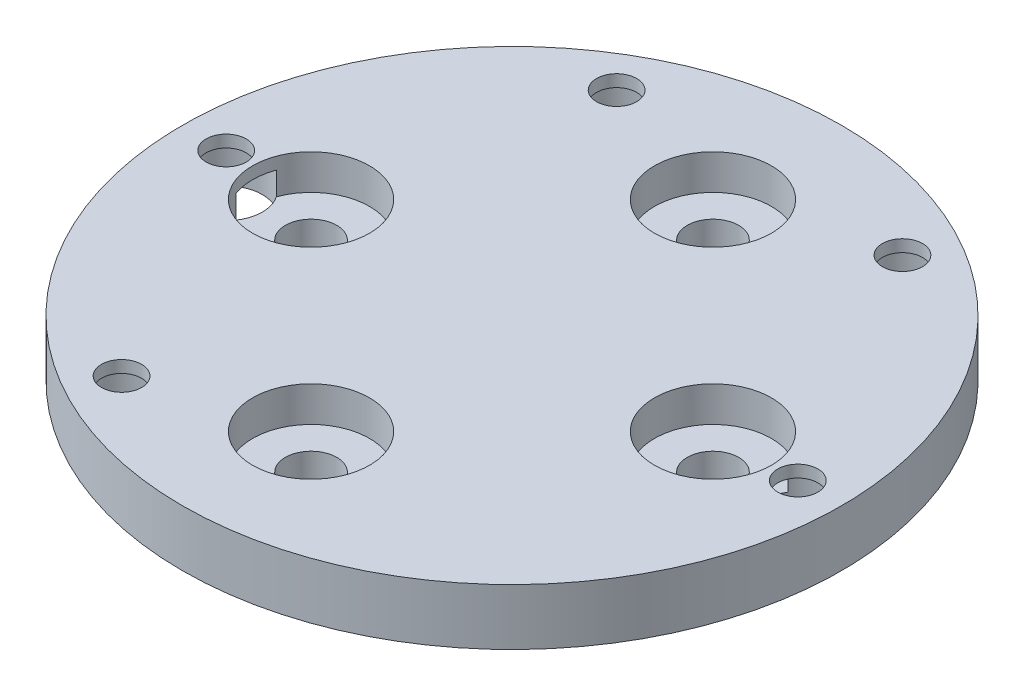
ISO-10303-21;
HEADER;
FILE_DESCRIPTION(('STEP AP214'),'2;1');
FILE_NAME('part.step','',(''),(''),'','','');
FILE_SCHEMA(('AUTOMOTIVE_DESIGN { 1 0 10303 214 1 1 1 1 }'));
ENDSEC;
DATA;
#1=APPLICATION_CONTEXT('core data for automotive mechanical design processes');
#2=APPLICATION_PROTOCOL_DEFINITION('international standard','automotive_design',2000,#1);
#3=PRODUCT_CONTEXT('',#1,'mechanical');
#4=PRODUCT('Part','Part','',(#3));
#5=PRODUCT_RELATED_PRODUCT_CATEGORY('part','',(#4));
#6=PRODUCT_DEFINITION_FORMATION('','',#4);
#7=PRODUCT_DEFINITION_CONTEXT('part definition',#1,'design');
#8=PRODUCT_DEFINITION('design','',#6,#7);
#9=PRODUCT_DEFINITION_SHAPE('','',#8);
#10=(LENGTH_UNIT() NAMED_UNIT(*) SI_UNIT(.MILLI.,.METRE.));
#11=(NAMED_UNIT(*) PLANE_ANGLE_UNIT() SI_UNIT($,.RADIAN.));
#12=(NAMED_UNIT(*) SI_UNIT($,.STERADIAN.) SOLID_ANGLE_UNIT());
#13=UNCERTAINTY_MEASURE_WITH_UNIT(LENGTH_MEASURE(1.E-05),#10,'distance_accuracy_value','');
#14=(GEOMETRIC_REPRESENTATION_CONTEXT(3) GLOBAL_UNCERTAINTY_ASSIGNED_CONTEXT((#13)) GLOBAL_UNIT_ASSIGNED_CONTEXT((#10,
#11,#12)) REPRESENTATION_CONTEXT('',''));
#15=CARTESIAN_POINT('',(0.,0.,0.));
#16=DIRECTION('',(0.,0.,1.));
#17=DIRECTION('',(1.,0.,0.));
#18=AXIS2_PLACEMENT_3D('',#15,#16,#17);
#19=CARTESIAN_POINT('',(0.,0.,0.));
#20=DIRECTION('',(0.,1.,0.));
#21=DIRECTION('',(0.,0.,1.));
#22=AXIS2_PLACEMENT_3D('',#19,#20,#21);
#23=PLANE('',#22);
#24=CARTESIAN_POINT('',(0.,0.,0.));
#25=DIRECTION('',(0.,1.,0.));
#26=DIRECTION('',(0.,0.,1.));
#27=AXIS2_PLACEMENT_3D('',#24,#25,#26);
#28=CIRCLE('',#27,41.);
#29=CARTESIAN_POINT('',(0.,0.,41.));
#30=VERTEX_POINT('',#29);
#31=EDGE_CURVE('E170',#30,#30,#28,.T.);
#32=ORIENTED_EDGE('',*,*,#31,.F.);
#33=EDGE_LOOP('',(#32));
#34=FACE_BOUND('',#33,.T.);
#35=CARTESIAN_POINT('',(17.7799999999998,0.,-30.7958633585747));
#36=DIRECTION('',(0.,-1.,0.));
#37=DIRECTION('',(0.,0.,-1.));
#38=AXIS2_PLACEMENT_3D('',#35,#36,#37);
#39=CIRCLE('',#38,4.5);
#40=CARTESIAN_POINT('',(17.7799999999998,0.,-35.2958633585747));
#41=VERTEX_POINT('',#40);
#42=EDGE_CURVE('E189',#41,#41,#39,.T.);
#43=ORIENTED_EDGE('',*,*,#42,.F.);
#44=EDGE_LOOP('',(#43));
#45=FACE_BOUND('',#44,.T.);
#46=CARTESIAN_POINT('',(-17.7800000000002,0.,-30.7958633585745));
#47=DIRECTION('',(0.,-1.,0.));
#48=DIRECTION('',(0.,0.,-1.));
#49=AXIS2_PLACEMENT_3D('',#46,#47,#48);
#50=CIRCLE('',#49,4.5);
#51=CARTESIAN_POINT('',(-17.7800000000002,0.,-35.2958633585745));
#52=VERTEX_POINT('',#51);
#53=EDGE_CURVE('E196',#52,#52,#50,.T.);
#54=ORIENTED_EDGE('',*,*,#53,.F.);
#55=EDGE_LOOP('',(#54));
#56=FACE_BOUND('',#55,.T.);
#57=CARTESIAN_POINT('',(35.56,0.,-1.31838984174237E-13));
#58=DIRECTION('',(0.,-1.,0.));
#59=DIRECTION('',(0.,0.,-1.));
#60=AXIS2_PLACEMENT_3D('',#57,#58,#59);
#61=CIRCLE('',#60,4.5);
#62=CARTESIAN_POINT('',(35.56,0.,-4.50000000000013));
#63=VERTEX_POINT('',#62);
#64=EDGE_CURVE('E88',#63,#63,#61,.T.);
#65=ORIENTED_EDGE('',*,*,#64,.F.);
#66=EDGE_LOOP('',(#65));
#67=FACE_BOUND('',#66,.T.);
#68=CARTESIAN_POINT('',(-35.56,0.,3.81639164714898E-13));
#69=DIRECTION('',(0.,-1.,0.));
#70=DIRECTION('',(0.,0.,-1.));
#71=AXIS2_PLACEMENT_3D('',#68,#69,#70);
#72=CIRCLE('',#71,4.5);
#73=CARTESIAN_POINT('',(-35.56,0.,-4.49999999999962));
#74=VERTEX_POINT('',#73);
#75=EDGE_CURVE('E87',#74,#74,#72,.T.);
#76=ORIENTED_EDGE('',*,*,#75,.F.);
#77=EDGE_LOOP('',(#76));
#78=FACE_BOUND('',#77,.T.);
#79=CARTESIAN_POINT('',(-17.78,0.,30.7958633585746));
#80=DIRECTION('',(0.,-1.,0.));
#81=DIRECTION('',(0.,0.,-1.));
#82=AXIS2_PLACEMENT_3D('',#79,#80,#81);
#83=CIRCLE('',#82,4.5);
#84=CARTESIAN_POINT('',(-17.78,0.,26.2958633585746));
#85=VERTEX_POINT('',#84);
#86=EDGE_CURVE('E207',#85,#85,#83,.T.);
#87=ORIENTED_EDGE('',*,*,#86,.F.);
#88=EDGE_LOOP('',(#87));
#89=FACE_BOUND('',#88,.T.);
#90=CARTESIAN_POINT('',(0.,0.,0.));
#91=DIRECTION('',(0.,1.,0.));
#92=DIRECTION('',(0.,0.,1.));
#93=AXIS2_PLACEMENT_3D('',#90,#91,#92);
#94=CIRCLE('',#93,30.);
#95=CARTESIAN_POINT('',(0.,0.,30.));
#96=VERTEX_POINT('',#95);
#97=EDGE_CURVE('E11',#96,#96,#94,.F.);
#98=ORIENTED_EDGE('',*,*,#97,.F.);
#99=EDGE_LOOP('',(#98));
#100=FACE_BOUND('',#99,.T.);
#101=ADVANCED_FACE('F35',(#34,#45,#56,#67,#78,#89,#100),#23,.F.);
#102=CARTESIAN_POINT('',(-17.78,0.,30.7958633585746));
#103=DIRECTION('',(0.,1.,0.));
#104=DIRECTION('',(0.,0.,1.));
#105=AXIS2_PLACEMENT_3D('',#102,#103,#104);
#106=CYLINDRICAL_SURFACE('',#105,2.49999999999999);
#107=CARTESIAN_POINT('',(-17.78,7.,30.7958633585746));
#108=DIRECTION('',(0.,1.,0.));
#109=DIRECTION('',(0.,0.,1.));
#110=AXIS2_PLACEMENT_3D('',#107,#108,#109);
#111=CIRCLE('',#110,2.49999999999999);
#112=CARTESIAN_POINT('',(-17.78,7.,33.2958633585746));
#113=VERTEX_POINT('',#112);
#114=EDGE_CURVE('E117',#113,#113,#111,.T.);
#115=ORIENTED_EDGE('',*,*,#114,.T.);
#116=EDGE_LOOP('',(#115));
#117=FACE_BOUND('',#116,.T.);
#118=CARTESIAN_POINT('',(-17.78,5.5,30.7958633585746));
#119=DIRECTION('',(0.,-1.,0.));
#120=DIRECTION('',(0.,0.,-1.));
#121=AXIS2_PLACEMENT_3D('',#118,#119,#120);
#122=CIRCLE('',#121,2.49999999999999);
#123=CARTESIAN_POINT('',(-17.78,5.5,28.2958633585746));
#124=VERTEX_POINT('',#123);
#125=EDGE_CURVE('E123',#124,#124,#122,.F.);
#126=ORIENTED_EDGE('',*,*,#125,.F.);
#127=EDGE_LOOP('',(#126));
#128=FACE_BOUND('',#127,.T.);
#129=ADVANCED_FACE('F247',(#117,#128),#106,.F.);
#130=CARTESIAN_POINT('',(-35.56,0.,3.81639164714898E-13));
#131=DIRECTION('',(0.,1.,0.));
#132=DIRECTION('',(0.,0.,1.));
#133=AXIS2_PLACEMENT_3D('',#130,#131,#132);
#134=CYLINDRICAL_SURFACE('',#133,2.49999999999999);
#135=CARTESIAN_POINT('',(-35.56,7.,3.81639164714898E-13));
#136=DIRECTION('',(0.,1.,0.));
#137=DIRECTION('',(0.,0.,1.));
#138=AXIS2_PLACEMENT_3D('',#135,#136,#137);
#139=CIRCLE('',#138,2.49999999999999);
#140=CARTESIAN_POINT('',(-35.56,7.,2.50000000000037));
#141=VERTEX_POINT('',#140);
#142=EDGE_CURVE('E121',#141,#141,#139,.T.);
#143=ORIENTED_EDGE('',*,*,#142,.T.);
#144=EDGE_LOOP('',(#143));
#145=FACE_BOUND('',#144,.T.);
#146=CARTESIAN_POINT('',(-35.56,5.5,3.81639164714898E-13));
#147=DIRECTION('',(0.,-1.,0.));
#148=DIRECTION('',(0.,0.,-1.));
#149=AXIS2_PLACEMENT_3D('',#146,#147,#148);
#150=CIRCLE('',#149,2.49999999999999);
#151=CARTESIAN_POINT('',(-35.56,5.5,-2.49999999999961));
#152=VERTEX_POINT('',#151);
#153=EDGE_CURVE('E183',#152,#152,#150,.F.);
#154=ORIENTED_EDGE('',*,*,#153,.F.);
#155=EDGE_LOOP('',(#154));
#156=FACE_BOUND('',#155,.T.);
#157=ADVANCED_FACE('F252',(#145,#156),#134,.F.);
#158=CARTESIAN_POINT('',(-17.7800000000002,0.,-30.7958633585745));
#159=DIRECTION('',(0.,1.,0.));
#160=DIRECTION('',(0.,0.,1.));
#161=AXIS2_PLACEMENT_3D('',#158,#159,#160);
#162=CYLINDRICAL_SURFACE('',#161,2.49999999999999);
#163=CARTESIAN_POINT('',(-17.7800000000002,7.,-30.7958633585745));
#164=DIRECTION('',(0.,1.,0.));
#165=DIRECTION('',(0.,0.,1.));
#166=AXIS2_PLACEMENT_3D('',#163,#164,#165);
#167=CIRCLE('',#166,2.49999999999999);
#168=CARTESIAN_POINT('',(-17.7800000000002,7.,-28.2958633585745));
#169=VERTEX_POINT('',#168);
#170=EDGE_CURVE('E134',#169,#169,#167,.T.);
#171=ORIENTED_EDGE('',*,*,#170,.T.);
#172=EDGE_LOOP('',(#171));
#173=FACE_BOUND('',#172,.T.);
#174=CARTESIAN_POINT('',(-17.7800000000002,5.5,-30.7958633585745));
#175=DIRECTION('',(0.,-1.,0.));
#176=DIRECTION('',(0.,0.,-1.));
#177=AXIS2_PLACEMENT_3D('',#174,#175,#176);
#178=CIRCLE('',#177,2.49999999999999);
#179=CARTESIAN_POINT('',(-17.7800000000002,5.5,-33.2958633585745));
#180=VERTEX_POINT('',#179);
#181=EDGE_CURVE('E180',#180,#180,#178,.F.);
#182=ORIENTED_EDGE('',*,*,#181,.F.);
#183=EDGE_LOOP('',(#182));
#184=FACE_BOUND('',#183,.T.);
#185=ADVANCED_FACE('F306',(#173,#184),#162,.F.);
#186=CARTESIAN_POINT('',(17.7799999999998,0.,-30.7958633585747));
#187=DIRECTION('',(0.,1.,0.));
#188=DIRECTION('',(0.,0.,1.));
#189=AXIS2_PLACEMENT_3D('',#186,#187,#188);
#190=CYLINDRICAL_SURFACE('',#189,2.49999999999999);
#191=CARTESIAN_POINT('',(17.7799999999998,7.,-30.7958633585747));
#192=DIRECTION('',(0.,1.,0.));
#193=DIRECTION('',(0.,0.,1.));
#194=AXIS2_PLACEMENT_3D('',#191,#192,#193);
#195=CIRCLE('',#194,2.49999999999999);
#196=CARTESIAN_POINT('',(17.7799999999998,7.,-28.2958633585747));
#197=VERTEX_POINT('',#196);
#198=EDGE_CURVE('E131',#197,#197,#195,.T.);
#199=ORIENTED_EDGE('',*,*,#198,.T.);
#200=EDGE_LOOP('',(#199));
#201=FACE_BOUND('',#200,.T.);
#202=CARTESIAN_POINT('',(17.7799999999998,5.5,-30.7958633585747));
#203=DIRECTION('',(0.,-1.,0.));
#204=DIRECTION('',(0.,0.,-1.));
#205=AXIS2_PLACEMENT_3D('',#202,#203,#204);
#206=CIRCLE('',#205,2.49999999999999);
#207=CARTESIAN_POINT('',(17.7799999999998,5.5,-33.2958633585747));
#208=VERTEX_POINT('',#207);
#209=EDGE_CURVE('E79',#208,#208,#206,.F.);
#210=ORIENTED_EDGE('',*,*,#209,.F.);
#211=EDGE_LOOP('',(#210));
#212=FACE_BOUND('',#211,.T.);
#213=ADVANCED_FACE('F310',(#201,#212),#190,.F.);
#214=CARTESIAN_POINT('',(35.56,0.,-1.31838984174237E-13));
#215=DIRECTION('',(0.,1.,0.));
#216=DIRECTION('',(0.,0.,1.));
#217=AXIS2_PLACEMENT_3D('',#214,#215,#216);
#218=CYLINDRICAL_SURFACE('',#217,2.49999999999999);
#219=CARTESIAN_POINT('',(35.56,7.,-1.31838984174237E-13));
#220=DIRECTION('',(0.,1.,0.));
#221=DIRECTION('',(0.,0.,1.));
#222=AXIS2_PLACEMENT_3D('',#219,#220,#221);
#223=CIRCLE('',#222,2.49999999999999);
#224=CARTESIAN_POINT('',(35.56,7.,2.49999999999986));
#225=VERTEX_POINT('',#224);
#226=EDGE_CURVE('E127',#225,#225,#223,.T.);
#227=ORIENTED_EDGE('',*,*,#226,.T.);
#228=EDGE_LOOP('',(#227));
#229=FACE_BOUND('',#228,.T.);
#230=CARTESIAN_POINT('',(35.56,5.5,-1.31838984174237E-13));
#231=DIRECTION('',(0.,-1.,0.));
#232=DIRECTION('',(0.,0.,-1.));
#233=AXIS2_PLACEMENT_3D('',#230,#231,#232);
#234=CIRCLE('',#233,2.49999999999999);
#235=CARTESIAN_POINT('',(35.56,5.5,-2.50000000000012));
#236=VERTEX_POINT('',#235);
#237=EDGE_CURVE('E80',#236,#236,#234,.F.);
#238=ORIENTED_EDGE('',*,*,#237,.F.);
#239=EDGE_LOOP('',(#238));
#240=FACE_BOUND('',#239,.T.);
#241=ADVANCED_FACE('F314',(#229,#240),#218,.F.);
#242=CARTESIAN_POINT('',(0.,7.,0.));
#243=DIRECTION('',(0.,-1.,0.));
#244=DIRECTION('',(0.,0.,-1.));
#245=AXIS2_PLACEMENT_3D('',#242,#243,#244);
#246=CYLINDRICAL_SURFACE('',#245,41.);
#247=CARTESIAN_POINT('',(0.,7.,0.));
#248=DIRECTION('',(0.,1.,0.));
#249=DIRECTION('',(0.,0.,1.));
#250=AXIS2_PLACEMENT_3D('',#247,#248,#249);
#251=CIRCLE('',#250,41.);
#252=CARTESIAN_POINT('',(0.,7.,41.));
#253=VERTEX_POINT('',#252);
#254=EDGE_CURVE('E99',#253,#253,#251,.T.);
#255=ORIENTED_EDGE('',*,*,#254,.F.);
#256=EDGE_LOOP('',(#255));
#257=FACE_BOUND('',#256,.T.);
#258=ORIENTED_EDGE('',*,*,#31,.T.);
#259=EDGE_LOOP('',(#258));
#260=FACE_BOUND('',#259,.T.);
#261=ADVANCED_FACE('F37',(#257,#260),#246,.T.);
#262=CARTESIAN_POINT('',(0.,7.,0.));
#263=DIRECTION('',(0.,1.,0.));
#264=DIRECTION('',(0.,0.,1.));
#265=AXIS2_PLACEMENT_3D('',#262,#263,#264);
#266=PLANE('',#265);
#267=ORIENTED_EDGE('',*,*,#226,.F.);
#268=EDGE_LOOP('',(#267));
#269=FACE_BOUND('',#268,.T.);
#270=ORIENTED_EDGE('',*,*,#198,.F.);
#271=EDGE_LOOP('',(#270));
#272=FACE_BOUND('',#271,.T.);
#273=ORIENTED_EDGE('',*,*,#170,.F.);
#274=EDGE_LOOP('',(#273));
#275=FACE_BOUND('',#274,.T.);
#276=ORIENTED_EDGE('',*,*,#142,.F.);
#277=EDGE_LOOP('',(#276));
#278=FACE_BOUND('',#277,.T.);
#279=ORIENTED_EDGE('',*,*,#114,.F.);
#280=EDGE_LOOP('',(#279));
#281=FACE_BOUND('',#280,.T.);
#282=CARTESIAN_POINT('',(25.,7.,-2.61861100413235E-13));
#283=DIRECTION('',(0.,1.,0.));
#284=DIRECTION('',(0.,0.,1.));
#285=AXIS2_PLACEMENT_3D('',#282,#283,#284);
#286=CIRCLE('',#285,7.275);
#287=CARTESIAN_POINT('',(25.,7.,7.27499999999973));
#288=VERTEX_POINT('',#287);
#289=EDGE_CURVE('E130',#288,#288,#286,.T.);
#290=ORIENTED_EDGE('',*,*,#289,.F.);
#291=EDGE_LOOP('',(#290));
#292=FACE_BOUND('',#291,.T.);
#293=CARTESIAN_POINT('',(0.,7.,25.));
#294=DIRECTION('',(0.,1.,0.));
#295=DIRECTION('',(0.,0.,1.));
#296=AXIS2_PLACEMENT_3D('',#293,#294,#295);
#297=CIRCLE('',#296,7.27499999999999);
#298=CARTESIAN_POINT('',(0.,7.,32.275));
#299=VERTEX_POINT('',#298);
#300=EDGE_CURVE('E145',#299,#299,#297,.T.);
#301=ORIENTED_EDGE('',*,*,#300,.F.);
#302=EDGE_LOOP('',(#301));
#303=FACE_BOUND('',#302,.T.);
#304=CARTESIAN_POINT('',(-25.,7.,0.));
#305=DIRECTION('',(0.,1.,0.));
#306=DIRECTION('',(0.,0.,1.));
#307=AXIS2_PLACEMENT_3D('',#304,#305,#306);
#308=CIRCLE('',#307,7.27499999999999);
#309=CARTESIAN_POINT('',(-25.,7.,7.27500000000008));
#310=VERTEX_POINT('',#309);
#311=EDGE_CURVE('E154',#310,#310,#308,.T.);
#312=ORIENTED_EDGE('',*,*,#311,.F.);
#313=EDGE_LOOP('',(#312));
#314=FACE_BOUND('',#313,.T.);
#315=CARTESIAN_POINT('',(0.,7.,-25.));
#316=DIRECTION('',(0.,1.,0.));
#317=DIRECTION('',(0.,0.,1.));
#318=AXIS2_PLACEMENT_3D('',#315,#316,#317);
#319=CIRCLE('',#318,7.27499999999999);
#320=CARTESIAN_POINT('',(0.,7.,-17.725));
#321=VERTEX_POINT('',#320);
#322=EDGE_CURVE('E161',#321,#321,#319,.T.);
#323=ORIENTED_EDGE('',*,*,#322,.F.);
#324=EDGE_LOOP('',(#323));
#325=FACE_BOUND('',#324,.T.);
#326=ORIENTED_EDGE('',*,*,#254,.T.);
#327=EDGE_LOOP('',(#326));
#328=FACE_BOUND('',#327,.T.);
#329=ADVANCED_FACE('F258',(#269,#272,#275,#278,#281,#292,#303,#314,#325,#328),#266,.T.);
#330=CARTESIAN_POINT('',(0.,7.,-25.));
#331=DIRECTION('',(0.,1.,0.));
#332=DIRECTION('',(0.,0.,1.));
#333=AXIS2_PLACEMENT_3D('',#330,#331,#332);
#334=CYLINDRICAL_SURFACE('',#333,3.2);
#335=CARTESIAN_POINT('',(0.,2.62,-25.));
#336=DIRECTION('',(0.,1.,0.));
#337=DIRECTION('',(0.,0.,1.));
#338=AXIS2_PLACEMENT_3D('',#335,#336,#337);
#339=CIRCLE('',#338,3.2);
#340=CARTESIAN_POINT('',(0.,2.62,-21.8));
#341=VERTEX_POINT('',#340);
#342=EDGE_CURVE('E167',#341,#341,#339,.T.);
#343=ORIENTED_EDGE('',*,*,#342,.T.);
#344=EDGE_LOOP('',(#343));
#345=FACE_BOUND('',#344,.T.);
#346=CARTESIAN_POINT('',(0.,-7.,-25.));
#347=DIRECTION('',(0.,-1.,0.));
#348=DIRECTION('',(0.,0.,-1.));
#349=AXIS2_PLACEMENT_3D('',#346,#347,#348);
#350=CIRCLE('',#349,3.20000000000001);
#351=CARTESIAN_POINT('',(0.,-7.,-28.2));
#352=VERTEX_POINT('',#351);
#353=EDGE_CURVE('E217',#352,#352,#350,.T.);
#354=ORIENTED_EDGE('',*,*,#353,.T.);
#355=EDGE_LOOP('',(#354));
#356=FACE_BOUND('',#355,.T.);
#357=ADVANCED_FACE('F261',(#345,#356),#334,.F.);
#358=CARTESIAN_POINT('',(3.2,2.62,-25.));
#359=DIRECTION('',(0.,-1.,0.));
#360=DIRECTION('',(0.,0.,-1.));
#361=AXIS2_PLACEMENT_3D('',#358,#359,#360);
#362=PLANE('',#361);
#363=ORIENTED_EDGE('',*,*,#342,.F.);
#364=EDGE_LOOP('',(#363));
#365=FACE_BOUND('',#364,.T.);
#366=CARTESIAN_POINT('',(0.,2.62,-25.));
#367=DIRECTION('',(0.,1.,0.));
#368=DIRECTION('',(0.,0.,1.));
#369=AXIS2_PLACEMENT_3D('',#366,#367,#368);
#370=CIRCLE('',#369,7.275);
#371=CARTESIAN_POINT('',(0.,2.62,-17.725));
#372=VERTEX_POINT('',#371);
#373=EDGE_CURVE('E164',#372,#372,#370,.T.);
#374=ORIENTED_EDGE('',*,*,#373,.T.);
#375=EDGE_LOOP('',(#374));
#376=FACE_BOUND('',#375,.T.);
#377=ADVANCED_FACE('F265',(#365,#376),#362,.F.);
#378=CARTESIAN_POINT('',(0.,7.,-25.));
#379=DIRECTION('',(0.,1.,0.));
#380=DIRECTION('',(0.,0.,1.));
#381=AXIS2_PLACEMENT_3D('',#378,#379,#380);
#382=CYLINDRICAL_SURFACE('',#381,7.275);
#383=ORIENTED_EDGE('',*,*,#373,.F.);
#384=EDGE_LOOP('',(#383));
#385=FACE_BOUND('',#384,.T.);
#386=ORIENTED_EDGE('',*,*,#322,.T.);
#387=EDGE_LOOP('',(#386));
#388=FACE_BOUND('',#387,.T.);
#389=ADVANCED_FACE('F269',(#385,#388),#382,.F.);
#390=CARTESIAN_POINT('',(-25.,7.,0.));
#391=DIRECTION('',(0.,1.,0.));
#392=DIRECTION('',(0.,0.,1.));
#393=AXIS2_PLACEMENT_3D('',#390,#391,#392);
#394=CYLINDRICAL_SURFACE('',#393,3.2);
#395=CARTESIAN_POINT('',(-25.,2.62,0.));
#396=DIRECTION('',(0.,1.,0.));
#397=DIRECTION('',(0.,0.,1.));
#398=AXIS2_PLACEMENT_3D('',#395,#396,#397);
#399=CIRCLE('',#398,3.2);
#400=CARTESIAN_POINT('',(-25.,2.62,3.20000000000008));
#401=VERTEX_POINT('',#400);
#402=EDGE_CURVE('E158',#401,#401,#399,.T.);
#403=ORIENTED_EDGE('',*,*,#402,.T.);
#404=EDGE_LOOP('',(#403));
#405=FACE_BOUND('',#404,.T.);
#406=CARTESIAN_POINT('',(-25.,-7.,0.));
#407=DIRECTION('',(0.,-1.,0.));
#408=DIRECTION('',(0.,0.,-1.));
#409=AXIS2_PLACEMENT_3D('',#406,#407,#408);
#410=CIRCLE('',#409,3.20000000000001);
#411=CARTESIAN_POINT('',(-25.,-7.,-3.19999999999992));
#412=VERTEX_POINT('',#411);
#413=EDGE_CURVE('E220',#412,#412,#410,.T.);
#414=ORIENTED_EDGE('',*,*,#413,.T.);
#415=EDGE_LOOP('',(#414));
#416=FACE_BOUND('',#415,.T.);
#417=ADVANCED_FACE('F273',(#405,#416),#394,.F.);
#418=CARTESIAN_POINT('',(-21.8,2.62,0.));
#419=DIRECTION('',(0.,-1.,0.));
#420=DIRECTION('',(0.,0.,-1.));
#421=AXIS2_PLACEMENT_3D('',#418,#419,#420);
#422=PLANE('',#421);
#423=ORIENTED_EDGE('',*,*,#402,.F.);
#424=EDGE_LOOP('',(#423));
#425=FACE_BOUND('',#424,.T.);
#426=CARTESIAN_POINT('',(-25.,2.62,0.));
#427=DIRECTION('',(0.,1.,0.));
#428=DIRECTION('',(0.,0.,1.));
#429=AXIS2_PLACEMENT_3D('',#426,#427,#428);
#430=CIRCLE('',#429,7.275);
#431=CARTESIAN_POINT('',(-31.8271413352272,2.62,2.51311881709412));
#432=VERTEX_POINT('',#431);
#433=CARTESIAN_POINT('',(-31.8271413352273,2.62,-2.51311881709357));
#434=VERTEX_POINT('',#433);
#435=EDGE_CURVE('E110',#432,#434,#430,.T.);
#436=ORIENTED_EDGE('',*,*,#435,.T.);
#437=CARTESIAN_POINT('',(-35.56,2.62,3.81639164714898E-13));
#438=DIRECTION('',(0.,-1.,0.));
#439=DIRECTION('',(0.,0.,-1.));
#440=AXIS2_PLACEMENT_3D('',#437,#438,#439);
#441=CIRCLE('',#440,4.5);
#442=EDGE_CURVE('E114',#434,#432,#441,.T.);
#443=ORIENTED_EDGE('',*,*,#442,.T.);
#444=EDGE_LOOP('',(#436,#443));
#445=FACE_BOUND('',#444,.T.);
#446=ADVANCED_FACE('F116',(#425,#445),#422,.F.);
#447=CARTESIAN_POINT('',(-25.,7.,0.));
#448=DIRECTION('',(0.,1.,0.));
#449=DIRECTION('',(0.,0.,1.));
#450=AXIS2_PLACEMENT_3D('',#447,#448,#449);
#451=CYLINDRICAL_SURFACE('',#450,7.275);
#452=ORIENTED_EDGE('',*,*,#435,.F.);
#453=DIRECTION('',(0.,-1.,0.));
#454=VECTOR('',#453,1.);
#455=CARTESIAN_POINT('',(-31.8271413352272,2.75,2.51311881709412));
#456=LINE('',#455,#454);
#457=CARTESIAN_POINT('',(-31.8271413352272,5.5,2.51311881709412));
#458=VERTEX_POINT('',#457);
#459=EDGE_CURVE('E43',#432,#458,#456,.F.);
#460=ORIENTED_EDGE('',*,*,#459,.T.);
#461=CARTESIAN_POINT('',(-25.,5.5,0.));
#462=DIRECTION('',(0.,-1.,0.));
#463=DIRECTION('',(0.,0.,-1.));
#464=AXIS2_PLACEMENT_3D('',#461,#462,#463);
#465=CIRCLE('',#464,7.275);
#466=CARTESIAN_POINT('',(-31.8271413352273,5.5,-2.51311881709357));
#467=VERTEX_POINT('',#466);
#468=EDGE_CURVE('E108',#467,#458,#465,.F.);
#469=ORIENTED_EDGE('',*,*,#468,.F.);
#470=DIRECTION('',(0.,-1.,0.));
#471=VECTOR('',#470,1.);
#472=CARTESIAN_POINT('',(-31.8271413352273,2.75,-2.51311881709357));
#473=LINE('',#472,#471);
#474=EDGE_CURVE('E95',#467,#434,#473,.T.);
#475=ORIENTED_EDGE('',*,*,#474,.T.);
#476=EDGE_LOOP('',(#452,#460,#469,#475));
#477=FACE_BOUND('',#476,.T.);
#478=ORIENTED_EDGE('',*,*,#311,.T.);
#479=EDGE_LOOP('',(#478));
#480=FACE_BOUND('',#479,.T.);
#481=ADVANCED_FACE('F106',(#477,#480),#451,.F.);
#482=CARTESIAN_POINT('',(0.,7.,25.));
#483=DIRECTION('',(0.,1.,0.));
#484=DIRECTION('',(0.,0.,1.));
#485=AXIS2_PLACEMENT_3D('',#482,#483,#484);
#486=CYLINDRICAL_SURFACE('',#485,3.2);
#487=CARTESIAN_POINT('',(0.,2.62,25.));
#488=DIRECTION('',(0.,1.,0.));
#489=DIRECTION('',(0.,0.,1.));
#490=AXIS2_PLACEMENT_3D('',#487,#488,#489);
#491=CIRCLE('',#490,3.2);
#492=CARTESIAN_POINT('',(0.,2.62,28.2));
#493=VERTEX_POINT('',#492);
#494=EDGE_CURVE('E151',#493,#493,#491,.T.);
#495=ORIENTED_EDGE('',*,*,#494,.T.);
#496=EDGE_LOOP('',(#495));
#497=FACE_BOUND('',#496,.T.);
#498=CARTESIAN_POINT('',(0.,-7.,25.));
#499=DIRECTION('',(0.,-1.,0.));
#500=DIRECTION('',(0.,0.,-1.));
#501=AXIS2_PLACEMENT_3D('',#498,#499,#500);
#502=CIRCLE('',#501,3.20000000000001);
#503=CARTESIAN_POINT('',(0.,-7.,21.8));
#504=VERTEX_POINT('',#503);
#505=EDGE_CURVE('E223',#504,#504,#502,.T.);
#506=ORIENTED_EDGE('',*,*,#505,.T.);
#507=EDGE_LOOP('',(#506));
#508=FACE_BOUND('',#507,.T.);
#509=ADVANCED_FACE('F227',(#497,#508),#486,.F.);
#510=CARTESIAN_POINT('',(3.2,2.62,25.));
#511=DIRECTION('',(0.,-1.,0.));
#512=DIRECTION('',(0.,0.,-1.));
#513=AXIS2_PLACEMENT_3D('',#510,#511,#512);
#514=PLANE('',#513);
#515=ORIENTED_EDGE('',*,*,#494,.F.);
#516=EDGE_LOOP('',(#515));
#517=FACE_BOUND('',#516,.T.);
#518=CARTESIAN_POINT('',(0.,2.62,25.));
#519=DIRECTION('',(0.,1.,0.));
#520=DIRECTION('',(0.,0.,1.));
#521=AXIS2_PLACEMENT_3D('',#518,#519,#520);
#522=CIRCLE('',#521,7.275);
#523=CARTESIAN_POINT('',(0.,2.62,32.275));
#524=VERTEX_POINT('',#523);
#525=EDGE_CURVE('E148',#524,#524,#522,.T.);
#526=ORIENTED_EDGE('',*,*,#525,.T.);
#527=EDGE_LOOP('',(#526));
#528=FACE_BOUND('',#527,.T.);
#529=ADVANCED_FACE('F285',(#517,#528),#514,.F.);
#530=CARTESIAN_POINT('',(0.,7.,25.));
#531=DIRECTION('',(0.,1.,0.));
#532=DIRECTION('',(0.,0.,1.));
#533=AXIS2_PLACEMENT_3D('',#530,#531,#532);
#534=CYLINDRICAL_SURFACE('',#533,7.275);
#535=ORIENTED_EDGE('',*,*,#525,.F.);
#536=EDGE_LOOP('',(#535));
#537=FACE_BOUND('',#536,.T.);
#538=ORIENTED_EDGE('',*,*,#300,.T.);
#539=EDGE_LOOP('',(#538));
#540=FACE_BOUND('',#539,.T.);
#541=ADVANCED_FACE('F289',(#537,#540),#534,.F.);
#542=CARTESIAN_POINT('',(25.,7.,-2.61861100413235E-13));
#543=DIRECTION('',(0.,1.,0.));
#544=DIRECTION('',(0.,0.,1.));
#545=AXIS2_PLACEMENT_3D('',#542,#543,#544);
#546=CYLINDRICAL_SURFACE('',#545,3.2);
#547=CARTESIAN_POINT('',(25.,2.62,-2.61861100413235E-13));
#548=DIRECTION('',(0.,1.,0.));
#549=DIRECTION('',(0.,0.,1.));
#550=AXIS2_PLACEMENT_3D('',#547,#548,#549);
#551=CIRCLE('',#550,3.2);
#552=CARTESIAN_POINT('',(25.,2.62,3.19999999999974));
#553=VERTEX_POINT('',#552);
#554=EDGE_CURVE('E142',#553,#553,#551,.T.);
#555=ORIENTED_EDGE('',*,*,#554,.T.);
#556=EDGE_LOOP('',(#555));
#557=FACE_BOUND('',#556,.T.);
#558=CARTESIAN_POINT('',(25.,-7.,-2.61861100413235E-13));
#559=DIRECTION('',(0.,-1.,0.));
#560=DIRECTION('',(0.,0.,-1.));
#561=AXIS2_PLACEMENT_3D('',#558,#559,#560);
#562=CIRCLE('',#561,3.20000000000001);
#563=CARTESIAN_POINT('',(25.,-7.,-3.20000000000027));
#564=VERTEX_POINT('',#563);
#565=EDGE_CURVE('E214',#564,#564,#562,.T.);
#566=ORIENTED_EDGE('',*,*,#565,.T.);
#567=EDGE_LOOP('',(#566));
#568=FACE_BOUND('',#567,.T.);
#569=ADVANCED_FACE('F293',(#557,#568),#546,.F.);
#570=CARTESIAN_POINT('',(28.2,2.62,-2.61861100413235E-13));
#571=DIRECTION('',(0.,-1.,0.));
#572=DIRECTION('',(0.,0.,-1.));
#573=AXIS2_PLACEMENT_3D('',#570,#571,#572);
#574=PLANE('',#573);
#575=ORIENTED_EDGE('',*,*,#554,.F.);
#576=EDGE_LOOP('',(#575));
#577=FACE_BOUND('',#576,.T.);
#578=CARTESIAN_POINT('',(25.,2.62,-2.61861100413235E-13));
#579=DIRECTION('',(0.,1.,0.));
#580=DIRECTION('',(0.,0.,1.));
#581=AXIS2_PLACEMENT_3D('',#578,#579,#580);
#582=CIRCLE('',#581,7.275);
#583=CARTESIAN_POINT('',(31.8271413352273,2.62,-2.51311881709402));
#584=VERTEX_POINT('',#583);
#585=CARTESIAN_POINT('',(31.8271413352272,2.62,2.51311881709366));
#586=VERTEX_POINT('',#585);
#587=EDGE_CURVE('E94',#584,#586,#582,.T.);
#588=ORIENTED_EDGE('',*,*,#587,.T.);
#589=CARTESIAN_POINT('',(35.56,2.62,-1.31838984174237E-13));
#590=DIRECTION('',(0.,-1.,0.));
#591=DIRECTION('',(0.,0.,-1.));
#592=AXIS2_PLACEMENT_3D('',#589,#590,#591);
#593=CIRCLE('',#592,4.5);
#594=EDGE_CURVE('E118',#586,#584,#593,.T.);
#595=ORIENTED_EDGE('',*,*,#594,.T.);
#596=EDGE_LOOP('',(#588,#595));
#597=FACE_BOUND('',#596,.T.);
#598=ADVANCED_FACE('F297',(#577,#597),#574,.F.);
#599=CARTESIAN_POINT('',(25.,7.,-2.61861100413235E-13));
#600=DIRECTION('',(0.,1.,0.));
#601=DIRECTION('',(0.,0.,1.));
#602=AXIS2_PLACEMENT_3D('',#599,#600,#601);
#603=CYLINDRICAL_SURFACE('',#602,7.275);
#604=ORIENTED_EDGE('',*,*,#587,.F.);
#605=DIRECTION('',(0.,-1.,0.));
#606=VECTOR('',#605,1.);
#607=CARTESIAN_POINT('',(31.8271413352273,2.75,-2.51311881709402));
#608=LINE('',#607,#606);
#609=CARTESIAN_POINT('',(31.8271413352273,5.5,-2.51311881709402));
#610=VERTEX_POINT('',#609);
#611=EDGE_CURVE('E84',#584,#610,#608,.F.);
#612=ORIENTED_EDGE('',*,*,#611,.T.);
#613=CARTESIAN_POINT('',(25.,5.5,-2.61861100413235E-13));
#614=DIRECTION('',(0.,-1.,0.));
#615=DIRECTION('',(0.,0.,-1.));
#616=AXIS2_PLACEMENT_3D('',#613,#614,#615);
#617=CIRCLE('',#616,7.275);
#618=CARTESIAN_POINT('',(31.8271413352272,5.5,2.51311881709366));
#619=VERTEX_POINT('',#618);
#620=EDGE_CURVE('E74',#619,#610,#617,.F.);
#621=ORIENTED_EDGE('',*,*,#620,.F.);
#622=DIRECTION('',(0.,-1.,0.));
#623=VECTOR('',#622,1.);
#624=CARTESIAN_POINT('',(31.8271413352272,2.75,2.51311881709366));
#625=LINE('',#624,#623);
#626=EDGE_CURVE('E86',#619,#586,#625,.T.);
#627=ORIENTED_EDGE('',*,*,#626,.T.);
#628=EDGE_LOOP('',(#604,#612,#621,#627));
#629=FACE_BOUND('',#628,.T.);
#630=ORIENTED_EDGE('',*,*,#289,.T.);
#631=EDGE_LOOP('',(#630));
#632=FACE_BOUND('',#631,.T.);
#633=ADVANCED_FACE('F91',(#629,#632),#603,.F.);
#634=CARTESIAN_POINT('',(35.56,5.5,-1.31838984174237E-13));
#635=DIRECTION('',(0.,-1.,0.));
#636=DIRECTION('',(0.,0.,-1.));
#637=AXIS2_PLACEMENT_3D('',#634,#635,#636);
#638=CYLINDRICAL_SURFACE('',#637,4.5);
#639=ORIENTED_EDGE('',*,*,#64,.T.);
#640=EDGE_LOOP('',(#639));
#641=FACE_BOUND('',#640,.T.);
#642=ORIENTED_EDGE('',*,*,#594,.F.);
#643=ORIENTED_EDGE('',*,*,#626,.F.);
#644=CARTESIAN_POINT('',(35.56,5.5,-1.31838984174237E-13));
#645=DIRECTION('',(0.,-1.,0.));
#646=DIRECTION('',(0.,0.,-1.));
#647=AXIS2_PLACEMENT_3D('',#644,#645,#646);
#648=CIRCLE('',#647,4.5);
#649=EDGE_CURVE('E56',#610,#619,#648,.T.);
#650=ORIENTED_EDGE('',*,*,#649,.F.);
#651=ORIENTED_EDGE('',*,*,#611,.F.);
#652=EDGE_LOOP('',(#642,#643,#650,#651));
#653=FACE_BOUND('',#652,.T.);
#654=ADVANCED_FACE('F83',(#641,#653),#638,.F.);
#655=CARTESIAN_POINT('',(35.56,5.5,-1.31838984174237E-13));
#656=DIRECTION('',(0.,-1.,0.));
#657=DIRECTION('',(0.,0.,-1.));
#658=AXIS2_PLACEMENT_3D('',#655,#656,#657);
#659=PLANE('',#658);
#660=ORIENTED_EDGE('',*,*,#237,.T.);
#661=EDGE_LOOP('',(#660));
#662=FACE_BOUND('',#661,.T.);
#663=ORIENTED_EDGE('',*,*,#620,.T.);
#664=ORIENTED_EDGE('',*,*,#649,.T.);
#665=EDGE_LOOP('',(#663,#664));
#666=FACE_BOUND('',#665,.T.);
#667=ADVANCED_FACE('F75',(#662,#666),#659,.T.);
#668=CARTESIAN_POINT('',(17.7799999999998,5.5,-30.7958633585747));
#669=DIRECTION('',(0.,-1.,0.));
#670=DIRECTION('',(0.,0.,-1.));
#671=AXIS2_PLACEMENT_3D('',#668,#669,#670);
#672=PLANE('',#671);
#673=CARTESIAN_POINT('',(17.7799999999998,5.5,-30.7958633585747));
#674=DIRECTION('',(0.,-1.,0.));
#675=DIRECTION('',(0.,0.,-1.));
#676=AXIS2_PLACEMENT_3D('',#673,#674,#675);
#677=CIRCLE('',#676,4.5);
#678=CARTESIAN_POINT('',(17.7799999999998,5.5,-35.2958633585747));
#679=VERTEX_POINT('',#678);
#680=EDGE_CURVE('E192',#679,#679,#677,.T.);
#681=ORIENTED_EDGE('',*,*,#680,.T.);
#682=EDGE_LOOP('',(#681));
#683=FACE_BOUND('',#682,.T.);
#684=ORIENTED_EDGE('',*,*,#209,.T.);
#685=EDGE_LOOP('',(#684));
#686=FACE_BOUND('',#685,.T.);
#687=ADVANCED_FACE('F323',(#683,#686),#672,.T.);
#688=CARTESIAN_POINT('',(17.7799999999998,5.5,-30.7958633585747));
#689=DIRECTION('',(0.,-1.,0.));
#690=DIRECTION('',(0.,0.,-1.));
#691=AXIS2_PLACEMENT_3D('',#688,#689,#690);
#692=CYLINDRICAL_SURFACE('',#691,4.5);
#693=ORIENTED_EDGE('',*,*,#680,.F.);
#694=EDGE_LOOP('',(#693));
#695=FACE_BOUND('',#694,.T.);
#696=ORIENTED_EDGE('',*,*,#42,.T.);
#697=EDGE_LOOP('',(#696));
#698=FACE_BOUND('',#697,.T.);
#699=ADVANCED_FACE('F319',(#695,#698),#692,.F.);
#700=CARTESIAN_POINT('',(-17.7800000000002,5.5,-30.7958633585745));
#701=DIRECTION('',(0.,-1.,0.));
#702=DIRECTION('',(0.,0.,-1.));
#703=AXIS2_PLACEMENT_3D('',#700,#701,#702);
#704=PLANE('',#703);
#705=CARTESIAN_POINT('',(-17.7800000000002,5.5,-30.7958633585745));
#706=DIRECTION('',(0.,-1.,0.));
#707=DIRECTION('',(0.,0.,-1.));
#708=AXIS2_PLACEMENT_3D('',#705,#706,#707);
#709=CIRCLE('',#708,4.5);
#710=CARTESIAN_POINT('',(-17.7800000000002,5.5,-35.2958633585745));
#711=VERTEX_POINT('',#710);
#712=EDGE_CURVE('E199',#711,#711,#709,.T.);
#713=ORIENTED_EDGE('',*,*,#712,.T.);
#714=EDGE_LOOP('',(#713));
#715=FACE_BOUND('',#714,.T.);
#716=ORIENTED_EDGE('',*,*,#181,.T.);
#717=EDGE_LOOP('',(#716));
#718=FACE_BOUND('',#717,.T.);
#719=ADVANCED_FACE('F322',(#715,#718),#704,.T.);
#720=CARTESIAN_POINT('',(-17.7800000000002,5.5,-30.7958633585745));
#721=DIRECTION('',(0.,-1.,0.));
#722=DIRECTION('',(0.,0.,-1.));
#723=AXIS2_PLACEMENT_3D('',#720,#721,#722);
#724=CYLINDRICAL_SURFACE('',#723,4.5);
#725=ORIENTED_EDGE('',*,*,#712,.F.);
#726=EDGE_LOOP('',(#725));
#727=FACE_BOUND('',#726,.T.);
#728=ORIENTED_EDGE('',*,*,#53,.T.);
#729=EDGE_LOOP('',(#728));
#730=FACE_BOUND('',#729,.T.);
#731=ADVANCED_FACE('F328',(#727,#730),#724,.F.);
#732=CARTESIAN_POINT('',(-35.56,5.5,3.81639164714898E-13));
#733=DIRECTION('',(0.,-1.,0.));
#734=DIRECTION('',(0.,0.,-1.));
#735=AXIS2_PLACEMENT_3D('',#732,#733,#734);
#736=CYLINDRICAL_SURFACE('',#735,4.5);
#737=ORIENTED_EDGE('',*,*,#75,.T.);
#738=EDGE_LOOP('',(#737));
#739=FACE_BOUND('',#738,.T.);
#740=ORIENTED_EDGE('',*,*,#442,.F.);
#741=ORIENTED_EDGE('',*,*,#474,.F.);
#742=CARTESIAN_POINT('',(-35.56,5.5,3.81639164714898E-13));
#743=DIRECTION('',(0.,-1.,0.));
#744=DIRECTION('',(0.,0.,-1.));
#745=AXIS2_PLACEMENT_3D('',#742,#743,#744);
#746=CIRCLE('',#745,4.5);
#747=EDGE_CURVE('E49',#458,#467,#746,.T.);
#748=ORIENTED_EDGE('',*,*,#747,.F.);
#749=ORIENTED_EDGE('',*,*,#459,.F.);
#750=EDGE_LOOP('',(#740,#741,#748,#749));
#751=FACE_BOUND('',#750,.T.);
#752=ADVANCED_FACE('F113',(#739,#751),#736,.F.);
#753=CARTESIAN_POINT('',(-35.56,5.5,3.81639164714898E-13));
#754=DIRECTION('',(0.,-1.,0.));
#755=DIRECTION('',(0.,0.,-1.));
#756=AXIS2_PLACEMENT_3D('',#753,#754,#755);
#757=PLANE('',#756);
#758=ORIENTED_EDGE('',*,*,#153,.T.);
#759=EDGE_LOOP('',(#758));
#760=FACE_BOUND('',#759,.T.);
#761=ORIENTED_EDGE('',*,*,#468,.T.);
#762=ORIENTED_EDGE('',*,*,#747,.T.);
#763=EDGE_LOOP('',(#761,#762));
#764=FACE_BOUND('',#763,.T.);
#765=ADVANCED_FACE('F343',(#760,#764),#757,.T.);
#766=CARTESIAN_POINT('',(-17.78,5.5,30.7958633585746));
#767=DIRECTION('',(0.,-1.,0.));
#768=DIRECTION('',(0.,0.,-1.));
#769=AXIS2_PLACEMENT_3D('',#766,#767,#768);
#770=PLANE('',#769);
#771=CARTESIAN_POINT('',(-17.78,5.5,30.7958633585746));
#772=DIRECTION('',(0.,-1.,0.));
#773=DIRECTION('',(0.,0.,-1.));
#774=AXIS2_PLACEMENT_3D('',#771,#772,#773);
#775=CIRCLE('',#774,4.5);
#776=CARTESIAN_POINT('',(-17.78,5.5,26.2958633585746));
#777=VERTEX_POINT('',#776);
#778=EDGE_CURVE('E177',#777,#777,#775,.T.);
#779=ORIENTED_EDGE('',*,*,#778,.T.);
#780=EDGE_LOOP('',(#779));
#781=FACE_BOUND('',#780,.T.);
#782=ORIENTED_EDGE('',*,*,#125,.T.);
#783=EDGE_LOOP('',(#782));
#784=FACE_BOUND('',#783,.T.);
#785=ADVANCED_FACE('F241',(#781,#784),#770,.T.);
#786=CARTESIAN_POINT('',(-17.78,5.5,30.7958633585746));
#787=DIRECTION('',(0.,-1.,0.));
#788=DIRECTION('',(0.,0.,-1.));
#789=AXIS2_PLACEMENT_3D('',#786,#787,#788);
#790=CYLINDRICAL_SURFACE('',#789,4.5);
#791=ORIENTED_EDGE('',*,*,#778,.F.);
#792=EDGE_LOOP('',(#791));
#793=FACE_BOUND('',#792,.T.);
#794=ORIENTED_EDGE('',*,*,#86,.T.);
#795=EDGE_LOOP('',(#794));
#796=FACE_BOUND('',#795,.T.);
#797=ADVANCED_FACE('F232',(#793,#796),#790,.F.);
#798=CARTESIAN_POINT('',(0.,-7.,0.));
#799=DIRECTION('',(0.,-1.,0.));
#800=DIRECTION('',(0.,0.,-1.));
#801=AXIS2_PLACEMENT_3D('',#798,#799,#800);
#802=PLANE('',#801);
#803=ORIENTED_EDGE('',*,*,#413,.F.);
#804=EDGE_LOOP('',(#803));
#805=FACE_BOUND('',#804,.T.);
#806=ORIENTED_EDGE('',*,*,#565,.F.);
#807=EDGE_LOOP('',(#806));
#808=FACE_BOUND('',#807,.T.);
#809=CARTESIAN_POINT('',(0.,-7.,0.));
#810=DIRECTION('',(0.,-1.,0.));
#811=DIRECTION('',(0.,0.,-1.));
#812=AXIS2_PLACEMENT_3D('',#809,#810,#811);
#813=CIRCLE('',#812,30.);
#814=CARTESIAN_POINT('',(0.,-7.,-30.));
#815=VERTEX_POINT('',#814);
#816=EDGE_CURVE('E193',#815,#815,#813,.T.);
#817=ORIENTED_EDGE('',*,*,#816,.T.);
#818=EDGE_LOOP('',(#817));
#819=FACE_BOUND('',#818,.T.);
#820=ORIENTED_EDGE('',*,*,#353,.F.);
#821=EDGE_LOOP('',(#820));
#822=FACE_BOUND('',#821,.T.);
#823=ORIENTED_EDGE('',*,*,#505,.F.);
#824=EDGE_LOOP('',(#823));
#825=FACE_BOUND('',#824,.T.);
#826=ADVANCED_FACE('F229',(#805,#808,#819,#822,#825),#802,.T.);
#827=CARTESIAN_POINT('',(0.,-7.,0.));
#828=DIRECTION('',(0.,1.,0.));
#829=DIRECTION('',(0.,0.,1.));
#830=AXIS2_PLACEMENT_3D('',#827,#828,#829);
#831=CYLINDRICAL_SURFACE('',#830,30.);
#832=ORIENTED_EDGE('',*,*,#816,.F.);
#833=EDGE_LOOP('',(#832));
#834=FACE_BOUND('',#833,.T.);
#835=ORIENTED_EDGE('',*,*,#97,.T.);
#836=EDGE_LOOP('',(#835));
#837=FACE_BOUND('',#836,.T.);
#838=ADVANCED_FACE('F231',(#834,#837),#831,.T.);
#839=CLOSED_SHELL('',(#101,#129,#157,#185,#213,#241,#261,#329,#357,#377,#389,#417,#446,#481,
#509,#529,#541,#569,#598,#633,#654,#667,#687,#699,#719,#731,#752,#765,#785,#797,#826,#838));
#840=MANIFOLD_SOLID_BREP('B2',#839);
#841=ADVANCED_BREP_SHAPE_REPRESENTATION('',(#18,#840),#14);
#842=SHAPE_DEFINITION_REPRESENTATION(#9,#841);
ENDSEC;
END-ISO-10303-21;
